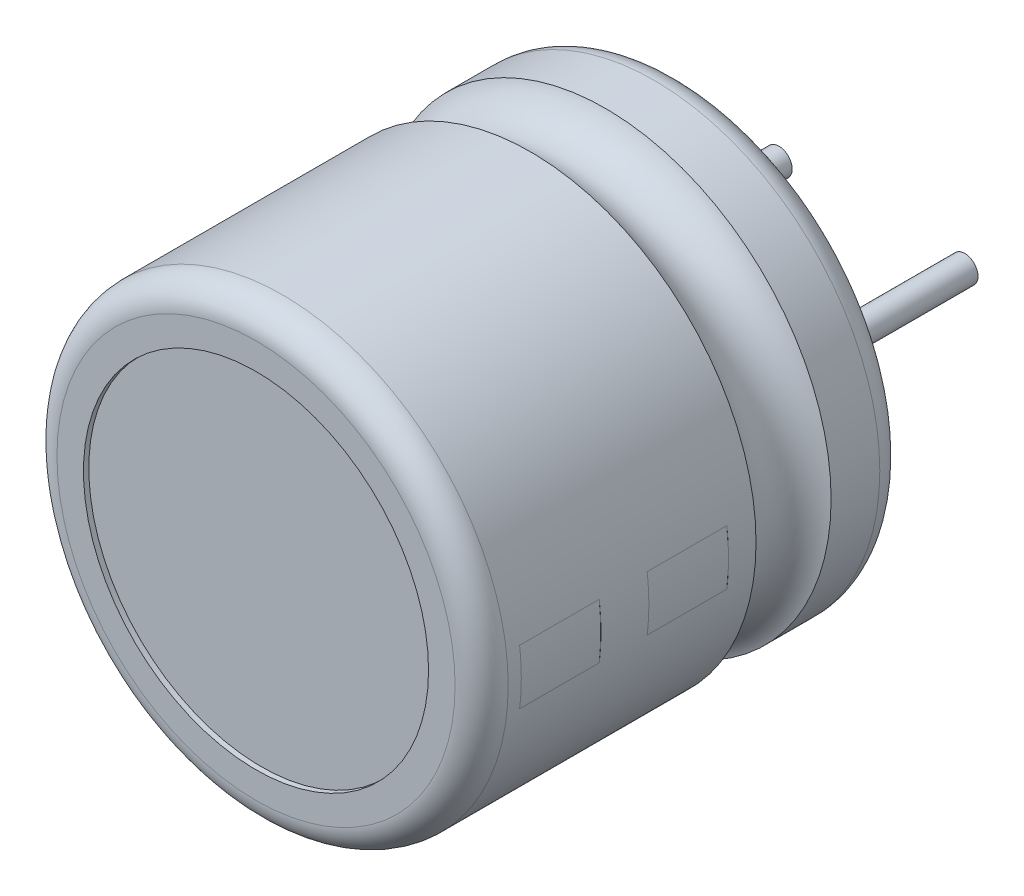
ISO-10303-21;
HEADER;
FILE_DESCRIPTION(('STEP AP214'),'2;1');
FILE_NAME('part.step','',(''),(''),'','','');
FILE_SCHEMA(('AUTOMOTIVE_DESIGN { 1 0 10303 214 1 1 1 1 }'));
ENDSEC;
DATA;
#1=APPLICATION_CONTEXT('core data for automotive mechanical design processes');
#2=APPLICATION_PROTOCOL_DEFINITION('international standard','automotive_design',2000,#1);
#3=PRODUCT_CONTEXT('',#1,'mechanical');
#4=PRODUCT('Part','Part','',(#3));
#5=PRODUCT_RELATED_PRODUCT_CATEGORY('part','',(#4));
#6=PRODUCT_DEFINITION_FORMATION('','',#4);
#7=PRODUCT_DEFINITION_CONTEXT('part definition',#1,'design');
#8=PRODUCT_DEFINITION('design','',#6,#7);
#9=PRODUCT_DEFINITION_SHAPE('','',#8);
#10=(LENGTH_UNIT() NAMED_UNIT(*) SI_UNIT(.MILLI.,.METRE.));
#11=(NAMED_UNIT(*) PLANE_ANGLE_UNIT() SI_UNIT($,.RADIAN.));
#12=(NAMED_UNIT(*) SI_UNIT($,.STERADIAN.) SOLID_ANGLE_UNIT());
#13=UNCERTAINTY_MEASURE_WITH_UNIT(LENGTH_MEASURE(1.E-05),#10,'distance_accuracy_value','');
#14=(GEOMETRIC_REPRESENTATION_CONTEXT(3) GLOBAL_UNCERTAINTY_ASSIGNED_CONTEXT((#13)) GLOBAL_UNIT_ASSIGNED_CONTEXT((#10,
#11,#12)) REPRESENTATION_CONTEXT('',''));
#15=CARTESIAN_POINT('',(0.,0.,0.));
#16=DIRECTION('',(0.,0.,1.));
#17=DIRECTION('',(1.,0.,0.));
#18=AXIS2_PLACEMENT_3D('',#15,#16,#17);
#19=CARTESIAN_POINT('',(4.119066529311,-0.505757775131,4.850664941783));
#20=DIRECTION('',(-0.121869343405041,-0.992546151641335,0.));
#21=DIRECTION('',(0.992546151641335,-0.121869343405041,0.));
#22=AXIS2_PLACEMENT_3D('',#19,#20,#21);
#23=PLANE('',#22);
#24=DIRECTION('',(0.992546151641335,-0.121869343405041,0.));
#25=VECTOR('',#24,1.);
#26=CARTESIAN_POINT('',(4.119066529311,-0.505757775131,4.850664941783));
#27=LINE('',#26,#25);
#28=CARTESIAN_POINT('',(4.21832114447565,-0.517944709471762,4.850664941783));
#29=VERTEX_POINT('',#28);
#30=CARTESIAN_POINT('',(4.11906652931126,-0.505757775131032,4.850664941783));
#31=VERTEX_POINT('',#30);
#32=EDGE_CURVE('P0_E62',#29,#31,#27,.F.);
#33=ORIENTED_EDGE('',*,*,#32,.T.);
#34=DIRECTION('',(0.,0.,1.));
#35=VECTOR('',#34,1.);
#36=CARTESIAN_POINT('',(4.119066529311,-0.505757775131,4.850664941783));
#37=LINE('',#36,#35);
#38=CARTESIAN_POINT('',(4.11906652931126,-0.505757775131032,3.350664941783));
#39=VERTEX_POINT('',#38);
#40=EDGE_CURVE('P0_E65',#31,#39,#37,.F.);
#41=ORIENTED_EDGE('',*,*,#40,.T.);
#42=DIRECTION('',(0.992546151641335,-0.121869343405041,0.));
#43=VECTOR('',#42,1.);
#44=CARTESIAN_POINT('',(4.119066529311,-0.505757775131,3.350664941783));
#45=LINE('',#44,#43);
#46=CARTESIAN_POINT('',(4.21832114447565,-0.517944709471762,3.350664941783));
#47=VERTEX_POINT('',#46);
#48=EDGE_CURVE('P0_E72',#39,#47,#45,.T.);
#49=ORIENTED_EDGE('',*,*,#48,.T.);
#50=DIRECTION('',(0.,0.,-1.));
#51=VECTOR('',#50,1.);
#52=CARTESIAN_POINT('',(4.21832114447562,-0.517944709471953,4.550664941783));
#53=LINE('',#52,#51);
#54=EDGE_CURVE('P0_E64',#29,#47,#53,.T.);
#55=ORIENTED_EDGE('',*,*,#54,.F.);
#56=EDGE_LOOP('',(#33,#41,#49,#55));
#57=FACE_BOUND('',#56,.T.);
#58=ADVANCED_FACE('P0_F17',(#57),#23,.T.);
#59=CARTESIAN_POINT('',(0.,0.,5.150664941783));
#60=DIRECTION('',(0.,0.,-1.));
#61=DIRECTION('',(-1.,0.,0.));
#62=AXIS2_PLACEMENT_3D('',#59,#60,#61);
#63=CYLINDRICAL_SURFACE('',#62,4.15);
#64=CARTESIAN_POINT('',(0.,0.,4.850664941783));
#65=DIRECTION('',(0.,0.,-1.));
#66=DIRECTION('',(-1.,0.,0.));
#67=AXIS2_PLACEMENT_3D('',#64,#65,#66);
#68=CIRCLE('',#67,4.15);
#69=CARTESIAN_POINT('',(4.11906652931123,0.505757775131224,4.850664941783));
#70=VERTEX_POINT('',#69);
#71=EDGE_CURVE('P0_E20',#70,#31,#68,.T.);
#72=ORIENTED_EDGE('',*,*,#71,.F.);
#73=DIRECTION('',(0.,0.,1.));
#74=VECTOR('',#73,1.);
#75=CARTESIAN_POINT('',(4.11906652931095,0.505757775131384,3.850664941783));
#76=LINE('',#75,#74);
#77=CARTESIAN_POINT('',(4.11906652931121,0.505757775131416,3.350664941783));
#78=VERTEX_POINT('',#77);
#79=EDGE_CURVE('P0_E82',#78,#70,#76,.T.);
#80=ORIENTED_EDGE('',*,*,#79,.F.);
#81=CARTESIAN_POINT('',(0.,0.,3.350664941783));
#82=DIRECTION('',(0.,0.,-1.));
#83=DIRECTION('',(-1.,0.,0.));
#84=AXIS2_PLACEMENT_3D('',#81,#82,#83);
#85=CIRCLE('',#84,4.15);
#86=EDGE_CURVE('P0_E55',#78,#39,#85,.T.);
#87=ORIENTED_EDGE('',*,*,#86,.T.);
#88=ORIENTED_EDGE('',*,*,#40,.F.);
#89=EDGE_LOOP('',(#72,#80,#87,#88));
#90=FACE_BOUND('',#89,.T.);
#91=ADVANCED_FACE('P0_F67',(#90),#63,.F.);
#92=CARTESIAN_POINT('',(4.186346410528,0.,3.350664941783));
#93=DIRECTION('',(0.,0.,1.));
#94=DIRECTION('',(1.,0.,0.));
#95=AXIS2_PLACEMENT_3D('',#92,#93,#94);
#96=PLANE('',#95);
#97=ORIENTED_EDGE('',*,*,#48,.F.);
#98=ORIENTED_EDGE('',*,*,#86,.F.);
#99=DIRECTION('',(-0.992546151641335,-0.121869343405041,0.));
#100=VECTOR('',#99,1.);
#101=CARTESIAN_POINT('',(4.218321144476,0.517944709472,3.350664941783));
#102=LINE('',#101,#100);
#103=CARTESIAN_POINT('',(4.21832114447562,0.517944709471954,3.350664941783));
#104=VERTEX_POINT('',#103);
#105=EDGE_CURVE('P0_E80',#104,#78,#102,.T.);
#106=ORIENTED_EDGE('',*,*,#105,.F.);
#107=CARTESIAN_POINT('',(0.,0.,3.350664941783));
#108=DIRECTION('',(0.,0.,-1.));
#109=DIRECTION('',(-1.,0.,0.));
#110=AXIS2_PLACEMENT_3D('',#107,#108,#109);
#111=CIRCLE('',#110,4.25);
#112=EDGE_CURVE('P0_E78',#47,#104,#111,.F.);
#113=ORIENTED_EDGE('',*,*,#112,.F.);
#114=EDGE_LOOP('',(#97,#98,#106,#113));
#115=FACE_BOUND('',#114,.T.);
#116=ADVANCED_FACE('P0_F91',(#115),#96,.F.);
#117=CARTESIAN_POINT('',(4.218321144476,0.517944709472,3.850664941783));
#118=DIRECTION('',(-0.121869343405041,0.992546151641335,0.));
#119=DIRECTION('',(-0.992546151641335,-0.121869343405041,0.));
#120=AXIS2_PLACEMENT_3D('',#117,#118,#119);
#121=PLANE('',#120);
#122=DIRECTION('',(-0.992546151640864,-0.121869343408879,0.));
#123=VECTOR('',#122,1.);
#124=CARTESIAN_POINT('',(4.218321144476,0.517944709472,4.850664941783));
#125=LINE('',#124,#123);
#126=CARTESIAN_POINT('',(4.21832114447562,0.517944709471954,4.850664941783));
#127=VERTEX_POINT('',#126);
#128=EDGE_CURVE('P0_E35',#127,#70,#125,.T.);
#129=ORIENTED_EDGE('',*,*,#128,.F.);
#130=DIRECTION('',(0.,0.,-1.));
#131=VECTOR('',#130,1.);
#132=CARTESIAN_POINT('',(4.21832114447562,0.517944709471954,4.550664941783));
#133=LINE('',#132,#131);
#134=EDGE_CURVE('P0_E26',#104,#127,#133,.F.);
#135=ORIENTED_EDGE('',*,*,#134,.F.);
#136=ORIENTED_EDGE('',*,*,#105,.T.);
#137=ORIENTED_EDGE('',*,*,#79,.T.);
#138=EDGE_LOOP('',(#129,#135,#136,#137));
#139=FACE_BOUND('',#138,.T.);
#140=ADVANCED_FACE('P0_F89',(#139),#121,.T.);
#141=CARTESIAN_POINT('',(4.186346410528,0.,4.850664941783));
#142=DIRECTION('',(0.,0.,1.));
#143=DIRECTION('',(1.,0.,0.));
#144=AXIS2_PLACEMENT_3D('',#141,#142,#143);
#145=PLANE('',#144);
#146=CARTESIAN_POINT('',(0.,0.,4.850664941783));
#147=DIRECTION('',(0.,0.,-1.));
#148=DIRECTION('',(-1.,0.,0.));
#149=AXIS2_PLACEMENT_3D('',#146,#147,#148);
#150=CIRCLE('',#149,4.25);
#151=EDGE_CURVE('P0_E11',#127,#29,#150,.T.);
#152=ORIENTED_EDGE('',*,*,#151,.F.);
#153=ORIENTED_EDGE('',*,*,#128,.T.);
#154=ORIENTED_EDGE('',*,*,#71,.T.);
#155=ORIENTED_EDGE('',*,*,#32,.F.);
#156=EDGE_LOOP('',(#152,#153,#154,#155));
#157=FACE_BOUND('',#156,.T.);
#158=ADVANCED_FACE('P0_F60',(#157),#145,.T.);
#159=CARTESIAN_POINT('',(0.,0.,4.550664941783));
#160=DIRECTION('',(0.,0.,-1.));
#161=DIRECTION('',(-1.,0.,0.));
#162=AXIS2_PLACEMENT_3D('',#159,#160,#161);
#163=CYLINDRICAL_SURFACE('',#162,4.25);
#164=ORIENTED_EDGE('',*,*,#134,.T.);
#165=ORIENTED_EDGE('',*,*,#151,.T.);
#166=ORIENTED_EDGE('',*,*,#54,.T.);
#167=ORIENTED_EDGE('',*,*,#112,.T.);
#168=EDGE_LOOP('',(#164,#165,#166,#167));
#169=FACE_BOUND('',#168,.T.);
#170=ADVANCED_FACE('P0_F86',(#169),#163,.T.);
#171=CLOSED_SHELL('',(#58,#91,#116,#140,#158,#170));
#172=MANIFOLD_SOLID_BREP('P0_B1',#171);
#173=CARTESIAN_POINT('',(4.119066529311,-0.505757775131,7.253360545845));
#174=DIRECTION('',(-0.121869343405041,-0.992546151641335,0.));
#175=DIRECTION('',(0.992546151641335,-0.121869343405041,0.));
#176=AXIS2_PLACEMENT_3D('',#173,#174,#175);
#177=PLANE('',#176);
#178=DIRECTION('',(0.992546151641335,-0.121869343405041,0.));
#179=VECTOR('',#178,1.);
#180=CARTESIAN_POINT('',(4.119066529311,-0.505757775131,7.253360545845));
#181=LINE('',#180,#179);
#182=CARTESIAN_POINT('',(4.21832114447565,-0.517944709471761,7.253360545845));
#183=VERTEX_POINT('',#182);
#184=CARTESIAN_POINT('',(4.11906652931126,-0.505757775131032,7.253360545845));
#185=VERTEX_POINT('',#184);
#186=EDGE_CURVE('P1_E62',#183,#185,#181,.F.);
#187=ORIENTED_EDGE('',*,*,#186,.T.);
#188=DIRECTION('',(0.,0.,1.));
#189=VECTOR('',#188,1.);
#190=CARTESIAN_POINT('',(4.119066529311,-0.505757775131,7.253360545845));
#191=LINE('',#190,#189);
#192=CARTESIAN_POINT('',(4.11906652931126,-0.505757775131032,5.753360545845));
#193=VERTEX_POINT('',#192);
#194=EDGE_CURVE('P1_E65',#185,#193,#191,.F.);
#195=ORIENTED_EDGE('',*,*,#194,.T.);
#196=DIRECTION('',(0.992546151641335,-0.121869343405041,0.));
#197=VECTOR('',#196,1.);
#198=CARTESIAN_POINT('',(4.119066529311,-0.505757775131,5.753360545845));
#199=LINE('',#198,#197);
#200=CARTESIAN_POINT('',(4.21832114447565,-0.517944709471761,5.753360545845));
#201=VERTEX_POINT('',#200);
#202=EDGE_CURVE('P1_E72',#193,#201,#199,.T.);
#203=ORIENTED_EDGE('',*,*,#202,.T.);
#204=DIRECTION('',(0.,0.,-1.));
#205=VECTOR('',#204,1.);
#206=CARTESIAN_POINT('',(4.21832114447562,-0.517944709471953,6.953360545845));
#207=LINE('',#206,#205);
#208=EDGE_CURVE('P1_E64',#183,#201,#207,.T.);
#209=ORIENTED_EDGE('',*,*,#208,.F.);
#210=EDGE_LOOP('',(#187,#195,#203,#209));
#211=FACE_BOUND('',#210,.T.);
#212=ADVANCED_FACE('P1_F17',(#211),#177,.T.);
#213=CARTESIAN_POINT('',(0.,0.,7.553360545845));
#214=DIRECTION('',(0.,0.,-1.));
#215=DIRECTION('',(-1.,0.,0.));
#216=AXIS2_PLACEMENT_3D('',#213,#214,#215);
#217=CYLINDRICAL_SURFACE('',#216,4.15);
#218=CARTESIAN_POINT('',(0.,0.,7.253360545845));
#219=DIRECTION('',(0.,0.,-1.));
#220=DIRECTION('',(-1.,0.,0.));
#221=AXIS2_PLACEMENT_3D('',#218,#219,#220);
#222=CIRCLE('',#221,4.15);
#223=CARTESIAN_POINT('',(4.11906652931123,0.505757775131224,7.253360545845));
#224=VERTEX_POINT('',#223);
#225=EDGE_CURVE('P1_E20',#224,#185,#222,.T.);
#226=ORIENTED_EDGE('',*,*,#225,.F.);
#227=DIRECTION('',(0.,0.,1.));
#228=VECTOR('',#227,1.);
#229=CARTESIAN_POINT('',(4.11906652931095,0.505757775131384,6.253360545845));
#230=LINE('',#229,#228);
#231=CARTESIAN_POINT('',(4.11906652931121,0.505757775131416,5.753360545845));
#232=VERTEX_POINT('',#231);
#233=EDGE_CURVE('P1_E82',#232,#224,#230,.T.);
#234=ORIENTED_EDGE('',*,*,#233,.F.);
#235=CARTESIAN_POINT('',(0.,0.,5.753360545845));
#236=DIRECTION('',(0.,0.,-1.));
#237=DIRECTION('',(-1.,0.,0.));
#238=AXIS2_PLACEMENT_3D('',#235,#236,#237);
#239=CIRCLE('',#238,4.15);
#240=EDGE_CURVE('P1_E55',#232,#193,#239,.T.);
#241=ORIENTED_EDGE('',*,*,#240,.T.);
#242=ORIENTED_EDGE('',*,*,#194,.F.);
#243=EDGE_LOOP('',(#226,#234,#241,#242));
#244=FACE_BOUND('',#243,.T.);
#245=ADVANCED_FACE('P1_F67',(#244),#217,.F.);
#246=CARTESIAN_POINT('',(4.186346410528,0.,5.753360545845));
#247=DIRECTION('',(0.,0.,1.));
#248=DIRECTION('',(1.,0.,0.));
#249=AXIS2_PLACEMENT_3D('',#246,#247,#248);
#250=PLANE('',#249);
#251=ORIENTED_EDGE('',*,*,#202,.F.);
#252=ORIENTED_EDGE('',*,*,#240,.F.);
#253=DIRECTION('',(-0.992546151641335,-0.121869343405041,0.));
#254=VECTOR('',#253,1.);
#255=CARTESIAN_POINT('',(4.218321144476,0.517944709472,5.753360545845));
#256=LINE('',#255,#254);
#257=CARTESIAN_POINT('',(4.21832114447562,0.517944709471954,5.753360545845));
#258=VERTEX_POINT('',#257);
#259=EDGE_CURVE('P1_E80',#258,#232,#256,.T.);
#260=ORIENTED_EDGE('',*,*,#259,.F.);
#261=CARTESIAN_POINT('',(0.,0.,5.753360545845));
#262=DIRECTION('',(0.,0.,-1.));
#263=DIRECTION('',(-1.,0.,0.));
#264=AXIS2_PLACEMENT_3D('',#261,#262,#263);
#265=CIRCLE('',#264,4.25);
#266=EDGE_CURVE('P1_E78',#201,#258,#265,.F.);
#267=ORIENTED_EDGE('',*,*,#266,.F.);
#268=EDGE_LOOP('',(#251,#252,#260,#267));
#269=FACE_BOUND('',#268,.T.);
#270=ADVANCED_FACE('P1_F91',(#269),#250,.F.);
#271=CARTESIAN_POINT('',(4.218321144476,0.517944709472,6.253360545845));
#272=DIRECTION('',(-0.121869343405041,0.992546151641335,0.));
#273=DIRECTION('',(-0.992546151641335,-0.121869343405041,0.));
#274=AXIS2_PLACEMENT_3D('',#271,#272,#273);
#275=PLANE('',#274);
#276=DIRECTION('',(-0.992546151640864,-0.121869343408879,0.));
#277=VECTOR('',#276,1.);
#278=CARTESIAN_POINT('',(4.218321144476,0.517944709472,7.253360545845));
#279=LINE('',#278,#277);
#280=CARTESIAN_POINT('',(4.21832114447562,0.517944709471954,7.253360545845));
#281=VERTEX_POINT('',#280);
#282=EDGE_CURVE('P1_E35',#281,#224,#279,.T.);
#283=ORIENTED_EDGE('',*,*,#282,.F.);
#284=DIRECTION('',(0.,0.,-1.));
#285=VECTOR('',#284,1.);
#286=CARTESIAN_POINT('',(4.21832114447562,0.517944709471954,6.953360545845));
#287=LINE('',#286,#285);
#288=EDGE_CURVE('P1_E26',#258,#281,#287,.F.);
#289=ORIENTED_EDGE('',*,*,#288,.F.);
#290=ORIENTED_EDGE('',*,*,#259,.T.);
#291=ORIENTED_EDGE('',*,*,#233,.T.);
#292=EDGE_LOOP('',(#283,#289,#290,#291));
#293=FACE_BOUND('',#292,.T.);
#294=ADVANCED_FACE('P1_F89',(#293),#275,.T.);
#295=CARTESIAN_POINT('',(4.186346410528,0.,7.253360545845));
#296=DIRECTION('',(0.,0.,1.));
#297=DIRECTION('',(1.,0.,0.));
#298=AXIS2_PLACEMENT_3D('',#295,#296,#297);
#299=PLANE('',#298);
#300=CARTESIAN_POINT('',(0.,0.,7.253360545845));
#301=DIRECTION('',(0.,0.,-1.));
#302=DIRECTION('',(-1.,0.,0.));
#303=AXIS2_PLACEMENT_3D('',#300,#301,#302);
#304=CIRCLE('',#303,4.25);
#305=EDGE_CURVE('P1_E11',#281,#183,#304,.T.);
#306=ORIENTED_EDGE('',*,*,#305,.F.);
#307=ORIENTED_EDGE('',*,*,#282,.T.);
#308=ORIENTED_EDGE('',*,*,#225,.T.);
#309=ORIENTED_EDGE('',*,*,#186,.F.);
#310=EDGE_LOOP('',(#306,#307,#308,#309));
#311=FACE_BOUND('',#310,.T.);
#312=ADVANCED_FACE('P1_F60',(#311),#299,.T.);
#313=CARTESIAN_POINT('',(0.,0.,6.953360545845));
#314=DIRECTION('',(0.,0.,-1.));
#315=DIRECTION('',(-1.,0.,0.));
#316=AXIS2_PLACEMENT_3D('',#313,#314,#315);
#317=CYLINDRICAL_SURFACE('',#316,4.25);
#318=ORIENTED_EDGE('',*,*,#288,.T.);
#319=ORIENTED_EDGE('',*,*,#305,.T.);
#320=ORIENTED_EDGE('',*,*,#208,.T.);
#321=ORIENTED_EDGE('',*,*,#266,.T.);
#322=EDGE_LOOP('',(#318,#319,#320,#321));
#323=FACE_BOUND('',#322,.T.);
#324=ADVANCED_FACE('P1_F86',(#323),#317,.T.);
#325=CLOSED_SHELL('',(#212,#245,#270,#294,#312,#324));
#326=MANIFOLD_SOLID_BREP('P1_B1',#325);
#327=CARTESIAN_POINT('',(0.,0.,0.2));
#328=DIRECTION('',(0.,0.,1.));
#329=DIRECTION('',(1.,0.,0.));
#330=AXIS2_PLACEMENT_3D('',#327,#328,#329);
#331=PLANE('',#330);
#332=CARTESIAN_POINT('',(0.,0.,0.2));
#333=DIRECTION('',(0.,0.,1.));
#334=DIRECTION('',(1.,0.,0.));
#335=AXIS2_PLACEMENT_3D('',#332,#333,#334);
#336=CIRCLE('',#335,3.25);
#337=CARTESIAN_POINT('',(3.25,0.,0.2));
#338=VERTEX_POINT('',#337);
#339=EDGE_CURVE('P2_E195',#338,#338,#336,.F.);
#340=ORIENTED_EDGE('',*,*,#339,.T.);
#341=EDGE_LOOP('',(#340));
#342=FACE_BOUND('',#341,.T.);
#343=ADVANCED_FACE('P2_F25',(#342),#331,.F.);
#344=CARTESIAN_POINT('',(0.,0.,0.));
#345=DIRECTION('',(0.,0.,1.));
#346=DIRECTION('',(1.,0.,0.));
#347=AXIS2_PLACEMENT_3D('',#344,#345,#346);
#348=CYLINDRICAL_SURFACE('',#347,3.25);
#349=ORIENTED_EDGE('',*,*,#339,.F.);
#350=EDGE_LOOP('',(#349));
#351=FACE_BOUND('',#350,.T.);
#352=CARTESIAN_POINT('',(0.,0.,0.));
#353=DIRECTION('',(0.,0.,1.));
#354=DIRECTION('',(1.,0.,0.));
#355=AXIS2_PLACEMENT_3D('',#352,#353,#354);
#356=CIRCLE('',#355,3.25);
#357=CARTESIAN_POINT('',(3.25,0.,0.));
#358=VERTEX_POINT('',#357);
#359=EDGE_CURVE('P2_E191',#358,#358,#356,.F.);
#360=ORIENTED_EDGE('',*,*,#359,.T.);
#361=EDGE_LOOP('',(#360));
#362=FACE_BOUND('',#361,.T.);
#363=ADVANCED_FACE('P2_F445',(#351,#362),#348,.F.);
#364=CARTESIAN_POINT('',(0.,0.,0.));
#365=DIRECTION('',(0.,0.,1.));
#366=DIRECTION('',(1.,0.,0.));
#367=AXIS2_PLACEMENT_3D('',#364,#365,#366);
#368=PLANE('',#367);
#369=ORIENTED_EDGE('',*,*,#359,.F.);
#370=EDGE_LOOP('',(#369));
#371=FACE_BOUND('',#370,.T.);
#372=CARTESIAN_POINT('',(0.,0.,0.));
#373=DIRECTION('',(0.,0.,1.));
#374=DIRECTION('',(-1.,0.,0.));
#375=AXIS2_PLACEMENT_3D('',#372,#373,#374);
#376=CIRCLE('',#375,3.75);
#377=CARTESIAN_POINT('',(-3.75,0.,0.));
#378=VERTEX_POINT('',#377);
#379=CARTESIAN_POINT('',(3.75,0.,0.));
#380=VERTEX_POINT('',#379);
#381=EDGE_CURVE('P2_E194',#378,#380,#376,.T.);
#382=ORIENTED_EDGE('',*,*,#381,.F.);
#383=CARTESIAN_POINT('',(0.,0.,0.));
#384=DIRECTION('',(0.,0.,1.));
#385=DIRECTION('',(1.,0.,0.));
#386=AXIS2_PLACEMENT_3D('',#383,#384,#385);
#387=CIRCLE('',#386,3.75);
#388=EDGE_CURVE('P2_E142',#380,#378,#387,.T.);
#389=ORIENTED_EDGE('',*,*,#388,.F.);
#390=EDGE_LOOP('',(#382,#389));
#391=FACE_BOUND('',#390,.T.);
#392=ADVANCED_FACE('P2_F153',(#371,#391),#368,.F.);
#393=CARTESIAN_POINT('',(0.,0.,0.5));
#394=DIRECTION('',(0.,0.,1.));
#395=DIRECTION('',(1.,0.,0.));
#396=AXIS2_PLACEMENT_3D('',#393,#394,#395);
#397=TOROIDAL_SURFACE('',#396,3.75,0.5);
#398=ORIENTED_EDGE('',*,*,#381,.T.);
#399=ORIENTED_EDGE('',*,*,#388,.T.);
#400=EDGE_LOOP('',(#398,#399));
#401=FACE_BOUND('',#400,.T.);
#402=CARTESIAN_POINT('',(0.,0.,0.5));
#403=DIRECTION('',(0.,0.,1.));
#404=DIRECTION('',(1.,0.,0.));
#405=AXIS2_PLACEMENT_3D('',#402,#403,#404);
#406=CIRCLE('',#405,4.25);
#407=CARTESIAN_POINT('',(4.25,0.,0.5));
#408=VERTEX_POINT('',#407);
#409=EDGE_CURVE('P2_E139',#408,#408,#406,.T.);
#410=ORIENTED_EDGE('',*,*,#409,.F.);
#411=EDGE_LOOP('',(#410));
#412=FACE_BOUND('',#411,.T.);
#413=ADVANCED_FACE('P2_F147',(#401,#412),#397,.T.);
#414=CARTESIAN_POINT('',(0.,0.,7.8));
#415=DIRECTION('',(0.,0.,1.));
#416=DIRECTION('',(1.,0.,0.));
#417=AXIS2_PLACEMENT_3D('',#414,#415,#416);
#418=PLANE('',#417);
#419=CARTESIAN_POINT('',(0.,0.,7.8));
#420=DIRECTION('',(0.,0.,1.));
#421=DIRECTION('',(1.,0.,0.));
#422=AXIS2_PLACEMENT_3D('',#419,#420,#421);
#423=CIRCLE('',#422,3.25);
#424=CARTESIAN_POINT('',(3.25,0.,7.8));
#425=VERTEX_POINT('',#424);
#426=EDGE_CURVE('P2_E138',#425,#425,#423,.T.);
#427=ORIENTED_EDGE('',*,*,#426,.T.);
#428=EDGE_LOOP('',(#427));
#429=FACE_BOUND('',#428,.T.);
#430=ADVANCED_FACE('P2_F152',(#429),#418,.T.);
#431=CARTESIAN_POINT('',(0.,0.,0.));
#432=DIRECTION('',(0.,0.,1.));
#433=DIRECTION('',(1.,0.,0.));
#434=AXIS2_PLACEMENT_3D('',#431,#432,#433);
#435=CYLINDRICAL_SURFACE('',#434,4.25);
#436=ORIENTED_EDGE('',*,*,#409,.T.);
#437=EDGE_LOOP('',(#436));
#438=FACE_BOUND('',#437,.T.);
#439=CARTESIAN_POINT('',(0.,0.,1.41732934011751));
#440=DIRECTION('',(0.,0.,1.));
#441=DIRECTION('',(1.,0.,0.));
#442=AXIS2_PLACEMENT_3D('',#439,#440,#441);
#443=CIRCLE('',#442,4.24999999999983);
#444=CARTESIAN_POINT('',(4.24999999999983,0.,1.41732934011751));
#445=VERTEX_POINT('',#444);
#446=EDGE_CURVE('P2_E135',#445,#445,#443,.F.);
#447=ORIENTED_EDGE('',*,*,#446,.T.);
#448=EDGE_LOOP('',(#447));
#449=FACE_BOUND('',#448,.T.);
#450=ADVANCED_FACE('P2_F417',(#438,#449),#435,.T.);
#451=CARTESIAN_POINT('',(0.,0.,5.8));
#452=DIRECTION('',(0.,0.,1.));
#453=DIRECTION('',(1.,0.,0.));
#454=AXIS2_PLACEMENT_3D('',#451,#452,#453);
#455=CYLINDRICAL_SURFACE('',#454,3.25);
#456=CARTESIAN_POINT('',(0.,0.,8.));
#457=DIRECTION('',(0.,0.,1.));
#458=DIRECTION('',(1.,0.,0.));
#459=AXIS2_PLACEMENT_3D('',#456,#457,#458);
#460=CIRCLE('',#459,3.25);
#461=CARTESIAN_POINT('',(3.25,0.,8.));
#462=VERTEX_POINT('',#461);
#463=EDGE_CURVE('P2_E186',#462,#462,#460,.F.);
#464=ORIENTED_EDGE('',*,*,#463,.F.);
#465=EDGE_LOOP('',(#464));
#466=FACE_BOUND('',#465,.T.);
#467=ORIENTED_EDGE('',*,*,#426,.F.);
#468=EDGE_LOOP('',(#467));
#469=FACE_BOUND('',#468,.T.);
#470=ADVANCED_FACE('P2_F410',(#466,#469),#455,.F.);
#471=CARTESIAN_POINT('',(4.119066529311,-0.505757775131,4.850664941783));
#472=DIRECTION('',(-0.121869343405041,-0.992546151641335,0.));
#473=DIRECTION('',(0.992546151641335,-0.121869343405041,0.));
#474=AXIS2_PLACEMENT_3D('',#471,#472,#473);
#475=PLANE('',#474);
#476=DIRECTION('',(0.,0.,1.));
#477=VECTOR('',#476,1.);
#478=CARTESIAN_POINT('',(4.119066529311,-0.505757775131,4.850664941783));
#479=LINE('',#478,#477);
#480=CARTESIAN_POINT('',(4.11906652931126,-0.505757775131032,4.850664941783));
#481=VERTEX_POINT('',#480);
#482=CARTESIAN_POINT('',(4.11906652931126,-0.505757775131032,3.350664941783));
#483=VERTEX_POINT('',#482);
#484=EDGE_CURVE('P2_E132',#481,#483,#479,.F.);
#485=ORIENTED_EDGE('',*,*,#484,.F.);
#486=DIRECTION('',(0.992546151641335,-0.121869343405041,0.));
#487=VECTOR('',#486,1.);
#488=CARTESIAN_POINT('',(4.119066529311,-0.505757775131,4.850664941783));
#489=LINE('',#488,#487);
#490=CARTESIAN_POINT('',(4.21832114447563,-0.517944709471761,4.850664941783));
#491=VERTEX_POINT('',#490);
#492=EDGE_CURVE('P2_E130',#491,#481,#489,.F.);
#493=ORIENTED_EDGE('',*,*,#492,.F.);
#494=DIRECTION('',(0.,0.,1.));
#495=VECTOR('',#494,1.);
#496=CARTESIAN_POINT('',(4.21832114447561,-0.517944709471954,0.));
#497=LINE('',#496,#495);
#498=CARTESIAN_POINT('',(4.21832114447563,-0.517944709471761,3.350664941783));
#499=VERTEX_POINT('',#498);
#500=EDGE_CURVE('P2_E184',#499,#491,#497,.T.);
#501=ORIENTED_EDGE('',*,*,#500,.F.);
#502=DIRECTION('',(0.992546151641335,-0.121869343405041,0.));
#503=VECTOR('',#502,1.);
#504=CARTESIAN_POINT('',(4.119066529311,-0.505757775131,3.350664941783));
#505=LINE('',#504,#503);
#506=EDGE_CURVE('P2_E121',#483,#499,#505,.T.);
#507=ORIENTED_EDGE('',*,*,#506,.F.);
#508=EDGE_LOOP('',(#485,#493,#501,#507));
#509=FACE_BOUND('',#508,.T.);
#510=ADVANCED_FACE('P2_F287',(#509),#475,.F.);
#511=CARTESIAN_POINT('',(4.119066529311,-0.505757775131,7.253360545845));
#512=DIRECTION('',(-0.121869343405041,-0.992546151641335,0.));
#513=DIRECTION('',(0.992546151641335,-0.121869343405041,0.));
#514=AXIS2_PLACEMENT_3D('',#511,#512,#513);
#515=PLANE('',#514);
#516=DIRECTION('',(0.,0.,1.));
#517=VECTOR('',#516,1.);
#518=CARTESIAN_POINT('',(4.119066529311,-0.505757775131,7.253360545845));
#519=LINE('',#518,#517);
#520=CARTESIAN_POINT('',(4.11906652931126,-0.505757775131032,7.253360545845));
#521=VERTEX_POINT('',#520);
#522=CARTESIAN_POINT('',(4.11906652931126,-0.505757775131032,5.753360545845));
#523=VERTEX_POINT('',#522);
#524=EDGE_CURVE('P2_E105',#521,#523,#519,.F.);
#525=ORIENTED_EDGE('',*,*,#524,.F.);
#526=DIRECTION('',(0.992546151641335,-0.121869343405041,0.));
#527=VECTOR('',#526,1.);
#528=CARTESIAN_POINT('',(4.119066529311,-0.505757775131,7.253360545845));
#529=LINE('',#528,#527);
#530=CARTESIAN_POINT('',(4.21832114447563,-0.517944709471761,7.253360545845));
#531=VERTEX_POINT('',#530);
#532=EDGE_CURVE('P2_E114',#531,#521,#529,.F.);
#533=ORIENTED_EDGE('',*,*,#532,.F.);
#534=DIRECTION('',(0.,0.,1.));
#535=VECTOR('',#534,1.);
#536=CARTESIAN_POINT('',(4.21832114447561,-0.517944709471954,0.));
#537=LINE('',#536,#535);
#538=CARTESIAN_POINT('',(4.21832114447563,-0.517944709471761,5.753360545845));
#539=VERTEX_POINT('',#538);
#540=EDGE_CURVE('P2_E238',#539,#531,#537,.T.);
#541=ORIENTED_EDGE('',*,*,#540,.F.);
#542=DIRECTION('',(0.992546151641335,-0.121869343405041,0.));
#543=VECTOR('',#542,1.);
#544=CARTESIAN_POINT('',(4.119066529311,-0.505757775131,5.753360545845));
#545=LINE('',#544,#543);
#546=EDGE_CURVE('P2_E124',#523,#539,#545,.T.);
#547=ORIENTED_EDGE('',*,*,#546,.F.);
#548=EDGE_LOOP('',(#525,#533,#541,#547));
#549=FACE_BOUND('',#548,.T.);
#550=ADVANCED_FACE('P2_F123',(#549),#515,.F.);
#551=CARTESIAN_POINT('',(0.,0.,8.));
#552=DIRECTION('',(0.,0.,1.));
#553=DIRECTION('',(1.,0.,0.));
#554=AXIS2_PLACEMENT_3D('',#551,#552,#553);
#555=PLANE('',#554);
#556=ORIENTED_EDGE('',*,*,#463,.T.);
#557=EDGE_LOOP('',(#556));
#558=FACE_BOUND('',#557,.T.);
#559=CARTESIAN_POINT('',(0.,0.,8.));
#560=DIRECTION('',(0.,0.,-1.));
#561=DIRECTION('',(1.,0.,0.));
#562=AXIS2_PLACEMENT_3D('',#559,#560,#561);
#563=CIRCLE('',#562,3.75);
#564=CARTESIAN_POINT('',(-3.75,0.,8.));
#565=VERTEX_POINT('',#564);
#566=CARTESIAN_POINT('',(3.75,0.,8.));
#567=VERTEX_POINT('',#566);
#568=EDGE_CURVE('P2_E126',#565,#567,#563,.F.);
#569=ORIENTED_EDGE('',*,*,#568,.T.);
#570=CARTESIAN_POINT('',(0.,0.,8.));
#571=DIRECTION('',(0.,0.,-1.));
#572=DIRECTION('',(-1.,0.,0.));
#573=AXIS2_PLACEMENT_3D('',#570,#571,#572);
#574=CIRCLE('',#573,3.75);
#575=EDGE_CURVE('P2_E111',#565,#567,#574,.T.);
#576=ORIENTED_EDGE('',*,*,#575,.F.);
#577=EDGE_LOOP('',(#569,#576));
#578=FACE_BOUND('',#577,.T.);
#579=ADVANCED_FACE('P2_F248',(#558,#578),#555,.T.);
#580=CARTESIAN_POINT('',(0.,0.,7.553360545845));
#581=DIRECTION('',(0.,0.,-1.));
#582=DIRECTION('',(-1.,0.,0.));
#583=AXIS2_PLACEMENT_3D('',#580,#581,#582);
#584=CYLINDRICAL_SURFACE('',#583,4.15);
#585=DIRECTION('',(0.,0.,1.));
#586=VECTOR('',#585,1.);
#587=CARTESIAN_POINT('',(4.11906652931095,0.505757775131384,6.253360545845));
#588=LINE('',#587,#586);
#589=CARTESIAN_POINT('',(4.11906652931123,0.505757775131224,5.753360545845));
#590=VERTEX_POINT('',#589);
#591=CARTESIAN_POINT('',(4.11906652931121,0.505757775131416,7.253360545845));
#592=VERTEX_POINT('',#591);
#593=EDGE_CURVE('P2_E108',#590,#592,#588,.T.);
#594=ORIENTED_EDGE('',*,*,#593,.T.);
#595=CARTESIAN_POINT('',(0.,0.,7.253360545845));
#596=DIRECTION('',(0.,0.,-1.));
#597=DIRECTION('',(-1.,0.,0.));
#598=AXIS2_PLACEMENT_3D('',#595,#596,#597);
#599=CIRCLE('',#598,4.15);
#600=EDGE_CURVE('P2_E101',#592,#521,#599,.T.);
#601=ORIENTED_EDGE('',*,*,#600,.T.);
#602=ORIENTED_EDGE('',*,*,#524,.T.);
#603=CARTESIAN_POINT('',(0.,0.,5.753360545845));
#604=DIRECTION('',(0.,0.,-1.));
#605=DIRECTION('',(-1.,0.,0.));
#606=AXIS2_PLACEMENT_3D('',#603,#604,#605);
#607=CIRCLE('',#606,4.15);
#608=EDGE_CURVE('P2_E94',#523,#590,#607,.F.);
#609=ORIENTED_EDGE('',*,*,#608,.T.);
#610=EDGE_LOOP('',(#594,#601,#602,#609));
#611=FACE_BOUND('',#610,.T.);
#612=ADVANCED_FACE('P2_F103',(#611),#584,.T.);
#613=CARTESIAN_POINT('',(0.,0.,5.150664941783));
#614=DIRECTION('',(0.,0.,-1.));
#615=DIRECTION('',(-1.,0.,0.));
#616=AXIS2_PLACEMENT_3D('',#613,#614,#615);
#617=CYLINDRICAL_SURFACE('',#616,4.15);
#618=DIRECTION('',(0.,0.,1.));
#619=VECTOR('',#618,1.);
#620=CARTESIAN_POINT('',(4.11906652931095,0.505757775131384,3.850664941783));
#621=LINE('',#620,#619);
#622=CARTESIAN_POINT('',(4.11906652931123,0.505757775131224,3.350664941783));
#623=VERTEX_POINT('',#622);
#624=CARTESIAN_POINT('',(4.11906652931121,0.505757775131416,4.850664941783));
#625=VERTEX_POINT('',#624);
#626=EDGE_CURVE('P2_E179',#623,#625,#621,.T.);
#627=ORIENTED_EDGE('',*,*,#626,.T.);
#628=CARTESIAN_POINT('',(0.,0.,4.850664941783));
#629=DIRECTION('',(0.,0.,-1.));
#630=DIRECTION('',(-1.,0.,0.));
#631=AXIS2_PLACEMENT_3D('',#628,#629,#630);
#632=CIRCLE('',#631,4.15);
#633=EDGE_CURVE('P2_E178',#625,#481,#632,.T.);
#634=ORIENTED_EDGE('',*,*,#633,.T.);
#635=ORIENTED_EDGE('',*,*,#484,.T.);
#636=CARTESIAN_POINT('',(0.,0.,3.350664941783));
#637=DIRECTION('',(0.,0.,-1.));
#638=DIRECTION('',(-1.,0.,0.));
#639=AXIS2_PLACEMENT_3D('',#636,#637,#638);
#640=CIRCLE('',#639,4.15);
#641=EDGE_CURVE('P2_E182',#483,#623,#640,.F.);
#642=ORIENTED_EDGE('',*,*,#641,.T.);
#643=EDGE_LOOP('',(#627,#634,#635,#642));
#644=FACE_BOUND('',#643,.T.);
#645=ADVANCED_FACE('P2_F378',(#644),#617,.T.);
#646=CARTESIAN_POINT('',(0.,0.,2.124436121304));
#647=DIRECTION('',(0.,0.,1.));
#648=DIRECTION('',(1.,0.,0.));
#649=AXIS2_PLACEMENT_3D('',#646,#647,#648);
#650=TOROIDAL_SURFACE('',#649,4.5,0.75);
#651=ORIENTED_EDGE('',*,*,#446,.F.);
#652=EDGE_LOOP('',(#651));
#653=FACE_BOUND('',#652,.T.);
#654=CARTESIAN_POINT('',(0.,0.,2.831542902491));
#655=DIRECTION('',(0.,0.,1.));
#656=DIRECTION('',(1.,0.,0.));
#657=AXIS2_PLACEMENT_3D('',#654,#655,#656);
#658=CIRCLE('',#657,4.25);
#659=CARTESIAN_POINT('',(4.25,0.,2.831542902491));
#660=VERTEX_POINT('',#659);
#661=EDGE_CURVE('P2_E231',#660,#660,#658,.T.);
#662=ORIENTED_EDGE('',*,*,#661,.F.);
#663=EDGE_LOOP('',(#662));
#664=FACE_BOUND('',#663,.T.);
#665=ADVANCED_FACE('P2_F218',(#653,#664),#650,.F.);
#666=CARTESIAN_POINT('',(0.,0.,7.5));
#667=DIRECTION('',(0.,0.,-1.));
#668=DIRECTION('',(-1.,0.,0.));
#669=AXIS2_PLACEMENT_3D('',#666,#667,#668);
#670=TOROIDAL_SURFACE('',#669,3.75,0.5);
#671=CARTESIAN_POINT('',(0.,0.,7.5));
#672=DIRECTION('',(0.,0.,1.));
#673=DIRECTION('',(1.,0.,0.));
#674=AXIS2_PLACEMENT_3D('',#671,#672,#673);
#675=CIRCLE('',#674,4.25);
#676=CARTESIAN_POINT('',(4.25,0.,7.5));
#677=VERTEX_POINT('',#676);
#678=EDGE_CURVE('P2_E177',#677,#677,#675,.F.);
#679=ORIENTED_EDGE('',*,*,#678,.F.);
#680=EDGE_LOOP('',(#679));
#681=FACE_BOUND('',#680,.T.);
#682=ORIENTED_EDGE('',*,*,#575,.T.);
#683=ORIENTED_EDGE('',*,*,#568,.F.);
#684=EDGE_LOOP('',(#682,#683));
#685=FACE_BOUND('',#684,.T.);
#686=ADVANCED_FACE('P2_F207',(#681,#685),#670,.T.);
#687=CARTESIAN_POINT('',(4.186346410528,0.,7.253360545845));
#688=DIRECTION('',(0.,0.,1.));
#689=DIRECTION('',(1.,0.,0.));
#690=AXIS2_PLACEMENT_3D('',#687,#688,#689);
#691=PLANE('',#690);
#692=DIRECTION('',(-0.992546151641335,-0.121869343405041,0.));
#693=VECTOR('',#692,1.);
#694=CARTESIAN_POINT('',(4.218321144476,0.517944709472,7.253360545845));
#695=LINE('',#694,#693);
#696=CARTESIAN_POINT('',(4.21832114447561,0.517944709471952,7.253360545845));
#697=VERTEX_POINT('',#696);
#698=EDGE_CURVE('P2_E227',#592,#697,#695,.F.);
#699=ORIENTED_EDGE('',*,*,#698,.T.);
#700=CARTESIAN_POINT('',(0.,0.,7.253360545845));
#701=DIRECTION('',(0.,0.,1.));
#702=DIRECTION('',(1.,0.,0.));
#703=AXIS2_PLACEMENT_3D('',#700,#701,#702);
#704=CIRCLE('',#703,4.25);
#705=EDGE_CURVE('P2_E117',#531,#697,#704,.T.);
#706=ORIENTED_EDGE('',*,*,#705,.F.);
#707=ORIENTED_EDGE('',*,*,#532,.T.);
#708=ORIENTED_EDGE('',*,*,#600,.F.);
#709=EDGE_LOOP('',(#699,#706,#707,#708));
#710=FACE_BOUND('',#709,.T.);
#711=ADVANCED_FACE('P2_F115',(#710),#691,.F.);
#712=CARTESIAN_POINT('',(4.218321144476,0.517944709472,6.253360545845));
#713=DIRECTION('',(-0.121869343405041,0.992546151641335,0.));
#714=DIRECTION('',(-0.992546151641335,-0.121869343405041,0.));
#715=AXIS2_PLACEMENT_3D('',#712,#713,#714);
#716=PLANE('',#715);
#717=DIRECTION('',(0.,0.,1.));
#718=VECTOR('',#717,1.);
#719=CARTESIAN_POINT('',(4.21832114447561,0.517944709471952,0.));
#720=LINE('',#719,#718);
#721=CARTESIAN_POINT('',(4.21832114447561,0.517944709471952,5.753360545845));
#722=VERTEX_POINT('',#721);
#723=EDGE_CURVE('P2_E175',#697,#722,#720,.F.);
#724=ORIENTED_EDGE('',*,*,#723,.F.);
#725=ORIENTED_EDGE('',*,*,#698,.F.);
#726=ORIENTED_EDGE('',*,*,#593,.F.);
#727=DIRECTION('',(-0.992546151640864,-0.121869343408879,0.));
#728=VECTOR('',#727,1.);
#729=CARTESIAN_POINT('',(4.218321144476,0.517944709472,5.753360545845));
#730=LINE('',#729,#728);
#731=EDGE_CURVE('P2_E180',#722,#590,#730,.T.);
#732=ORIENTED_EDGE('',*,*,#731,.F.);
#733=EDGE_LOOP('',(#724,#725,#726,#732));
#734=FACE_BOUND('',#733,.T.);
#735=ADVANCED_FACE('P2_F302',(#734),#716,.F.);
#736=CARTESIAN_POINT('',(4.186346410528,0.,5.753360545845));
#737=DIRECTION('',(0.,0.,1.));
#738=DIRECTION('',(1.,0.,0.));
#739=AXIS2_PLACEMENT_3D('',#736,#737,#738);
#740=PLANE('',#739);
#741=ORIENTED_EDGE('',*,*,#608,.F.);
#742=ORIENTED_EDGE('',*,*,#546,.T.);
#743=CARTESIAN_POINT('',(0.,0.,5.753360545845));
#744=DIRECTION('',(0.,0.,1.));
#745=DIRECTION('',(1.,0.,0.));
#746=AXIS2_PLACEMENT_3D('',#743,#744,#745);
#747=CIRCLE('',#746,4.25);
#748=EDGE_CURVE('P2_E173',#722,#539,#747,.F.);
#749=ORIENTED_EDGE('',*,*,#748,.F.);
#750=ORIENTED_EDGE('',*,*,#731,.T.);
#751=EDGE_LOOP('',(#741,#742,#749,#750));
#752=FACE_BOUND('',#751,.T.);
#753=ADVANCED_FACE('P2_F303',(#752),#740,.T.);
#754=CARTESIAN_POINT('',(4.186346410528,0.,4.850664941783));
#755=DIRECTION('',(0.,0.,1.));
#756=DIRECTION('',(1.,0.,0.));
#757=AXIS2_PLACEMENT_3D('',#754,#755,#756);
#758=PLANE('',#757);
#759=DIRECTION('',(-0.992546151641335,-0.121869343405041,0.));
#760=VECTOR('',#759,1.);
#761=CARTESIAN_POINT('',(4.218321144476,0.517944709472,4.850664941783));
#762=LINE('',#761,#760);
#763=CARTESIAN_POINT('',(4.21832114447561,0.517944709471952,4.850664941783));
#764=VERTEX_POINT('',#763);
#765=EDGE_CURVE('P2_E235',#625,#764,#762,.F.);
#766=ORIENTED_EDGE('',*,*,#765,.T.);
#767=CARTESIAN_POINT('',(0.,0.,4.850664941783));
#768=DIRECTION('',(0.,0.,1.));
#769=DIRECTION('',(1.,0.,0.));
#770=AXIS2_PLACEMENT_3D('',#767,#768,#769);
#771=CIRCLE('',#770,4.25);
#772=EDGE_CURVE('P2_E170',#491,#764,#771,.T.);
#773=ORIENTED_EDGE('',*,*,#772,.F.);
#774=ORIENTED_EDGE('',*,*,#492,.T.);
#775=ORIENTED_EDGE('',*,*,#633,.F.);
#776=EDGE_LOOP('',(#766,#773,#774,#775));
#777=FACE_BOUND('',#776,.T.);
#778=ADVANCED_FACE('P2_F305',(#777),#758,.F.);
#779=CARTESIAN_POINT('',(4.218321144476,0.517944709472,3.850664941783));
#780=DIRECTION('',(-0.121869343405041,0.992546151641335,0.));
#781=DIRECTION('',(-0.992546151641335,-0.121869343405041,0.));
#782=AXIS2_PLACEMENT_3D('',#779,#780,#781);
#783=PLANE('',#782);
#784=DIRECTION('',(0.,0.,1.));
#785=VECTOR('',#784,1.);
#786=CARTESIAN_POINT('',(4.21832114447561,0.517944709471952,0.));
#787=LINE('',#786,#785);
#788=CARTESIAN_POINT('',(4.21832114447561,0.517944709471952,3.350664941783));
#789=VERTEX_POINT('',#788);
#790=EDGE_CURVE('P2_E36',#764,#789,#787,.F.);
#791=ORIENTED_EDGE('',*,*,#790,.F.);
#792=ORIENTED_EDGE('',*,*,#765,.F.);
#793=ORIENTED_EDGE('',*,*,#626,.F.);
#794=DIRECTION('',(-0.992546151640864,-0.121869343408879,0.));
#795=VECTOR('',#794,1.);
#796=CARTESIAN_POINT('',(4.218321144476,0.517944709472,3.350664941783));
#797=LINE('',#796,#795);
#798=EDGE_CURVE('P2_E45',#789,#623,#797,.T.);
#799=ORIENTED_EDGE('',*,*,#798,.F.);
#800=EDGE_LOOP('',(#791,#792,#793,#799));
#801=FACE_BOUND('',#800,.T.);
#802=ADVANCED_FACE('P2_F312',(#801),#783,.F.);
#803=CARTESIAN_POINT('',(4.186346410528,0.,3.350664941783));
#804=DIRECTION('',(0.,0.,1.));
#805=DIRECTION('',(1.,0.,0.));
#806=AXIS2_PLACEMENT_3D('',#803,#804,#805);
#807=PLANE('',#806);
#808=ORIENTED_EDGE('',*,*,#641,.F.);
#809=ORIENTED_EDGE('',*,*,#506,.T.);
#810=CARTESIAN_POINT('',(0.,0.,3.350664941783));
#811=DIRECTION('',(0.,0.,1.));
#812=DIRECTION('',(1.,0.,0.));
#813=AXIS2_PLACEMENT_3D('',#810,#811,#812);
#814=CIRCLE('',#813,4.25);
#815=EDGE_CURVE('P2_E13',#789,#499,#814,.F.);
#816=ORIENTED_EDGE('',*,*,#815,.F.);
#817=ORIENTED_EDGE('',*,*,#798,.T.);
#818=EDGE_LOOP('',(#808,#809,#816,#817));
#819=FACE_BOUND('',#818,.T.);
#820=ADVANCED_FACE('P2_F282',(#819),#807,.T.);
#821=CARTESIAN_POINT('',(0.,0.,0.));
#822=DIRECTION('',(0.,0.,1.));
#823=DIRECTION('',(1.,0.,0.));
#824=AXIS2_PLACEMENT_3D('',#821,#822,#823);
#825=CYLINDRICAL_SURFACE('',#824,4.25);
#826=ORIENTED_EDGE('',*,*,#748,.T.);
#827=ORIENTED_EDGE('',*,*,#540,.T.);
#828=ORIENTED_EDGE('',*,*,#705,.T.);
#829=ORIENTED_EDGE('',*,*,#723,.T.);
#830=EDGE_LOOP('',(#826,#827,#828,#829));
#831=FACE_BOUND('',#830,.T.);
#832=ORIENTED_EDGE('',*,*,#678,.T.);
#833=EDGE_LOOP('',(#832));
#834=FACE_BOUND('',#833,.T.);
#835=ORIENTED_EDGE('',*,*,#661,.T.);
#836=EDGE_LOOP('',(#835));
#837=FACE_BOUND('',#836,.T.);
#838=ORIENTED_EDGE('',*,*,#790,.T.);
#839=ORIENTED_EDGE('',*,*,#815,.T.);
#840=ORIENTED_EDGE('',*,*,#500,.T.);
#841=ORIENTED_EDGE('',*,*,#772,.T.);
#842=EDGE_LOOP('',(#838,#839,#840,#841));
#843=FACE_BOUND('',#842,.T.);
#844=ADVANCED_FACE('P2_F290',(#831,#834,#837,#843),#825,.T.);
#845=CLOSED_SHELL('',(#343,#363,#392,#413,#430,#450,#470,#510,#550,#579,#612,#645,#665,#686,
#711,#735,#753,#778,#802,#820,#844));
#846=MANIFOLD_SOLID_BREP('P2_B1',#845);
#847=CARTESIAN_POINT('',(0.,0.,7.8));
#848=DIRECTION('',(0.,0.,1.));
#849=DIRECTION('',(1.,0.,0.));
#850=AXIS2_PLACEMENT_3D('',#847,#848,#849);
#851=PLANE('',#850);
#852=CARTESIAN_POINT('',(0.,0.,7.8));
#853=DIRECTION('',(0.,0.,1.));
#854=DIRECTION('',(1.,0.,0.));
#855=AXIS2_PLACEMENT_3D('',#852,#853,#854);
#856=CIRCLE('',#855,3.25);
#857=CARTESIAN_POINT('',(3.25,0.,7.8));
#858=VERTEX_POINT('',#857);
#859=EDGE_CURVE('P3_E18',#858,#858,#856,.T.);
#860=ORIENTED_EDGE('',*,*,#859,.F.);
#861=EDGE_LOOP('',(#860));
#862=FACE_BOUND('',#861,.T.);
#863=ADVANCED_FACE('P3_F15',(#862),#851,.F.);
#864=CARTESIAN_POINT('',(0.,0.,7.8));
#865=DIRECTION('',(0.,0.,1.));
#866=DIRECTION('',(1.,0.,0.));
#867=AXIS2_PLACEMENT_3D('',#864,#865,#866);
#868=CYLINDRICAL_SURFACE('',#867,3.25);
#869=ORIENTED_EDGE('',*,*,#859,.T.);
#870=EDGE_LOOP('',(#869));
#871=FACE_BOUND('',#870,.T.);
#872=CARTESIAN_POINT('',(0.,0.,7.9));
#873=DIRECTION('',(0.,0.,1.));
#874=DIRECTION('',(1.,0.,0.));
#875=AXIS2_PLACEMENT_3D('',#872,#873,#874);
#876=CIRCLE('',#875,3.25);
#877=CARTESIAN_POINT('',(3.25,0.,7.9));
#878=VERTEX_POINT('',#877);
#879=EDGE_CURVE('P3_E10',#878,#878,#876,.T.);
#880=ORIENTED_EDGE('',*,*,#879,.F.);
#881=EDGE_LOOP('',(#880));
#882=FACE_BOUND('',#881,.T.);
#883=ADVANCED_FACE('P3_F27',(#871,#882),#868,.T.);
#884=CARTESIAN_POINT('',(0.,0.,7.9));
#885=DIRECTION('',(0.,0.,1.));
#886=DIRECTION('',(1.,0.,0.));
#887=AXIS2_PLACEMENT_3D('',#884,#885,#886);
#888=PLANE('',#887);
#889=ORIENTED_EDGE('',*,*,#879,.T.);
#890=EDGE_LOOP('',(#889));
#891=FACE_BOUND('',#890,.T.);
#892=ADVANCED_FACE('P3_F35',(#891),#888,.T.);
#893=CLOSED_SHELL('',(#863,#883,#892));
#894=MANIFOLD_SOLID_BREP('P3_B1',#893);
#895=CARTESIAN_POINT('',(0.,0.,0.2));
#896=DIRECTION('',(0.,0.,1.));
#897=DIRECTION('',(1.,0.,0.));
#898=AXIS2_PLACEMENT_3D('',#895,#896,#897);
#899=PLANE('',#898);
#900=CARTESIAN_POINT('',(0.,0.,0.2));
#901=DIRECTION('',(0.,0.,-1.));
#902=DIRECTION('',(-1.,0.,0.));
#903=AXIS2_PLACEMENT_3D('',#900,#901,#902);
#904=CIRCLE('',#903,3.25);
#905=CARTESIAN_POINT('',(-3.25,0.,0.2));
#906=VERTEX_POINT('',#905);
#907=EDGE_CURVE('P4_E18',#906,#906,#904,.T.);
#908=ORIENTED_EDGE('',*,*,#907,.F.);
#909=EDGE_LOOP('',(#908));
#910=FACE_BOUND('',#909,.T.);
#911=ADVANCED_FACE('P4_F15',(#910),#899,.T.);
#912=CARTESIAN_POINT('',(0.,0.,0.2));
#913=DIRECTION('',(0.,0.,-1.));
#914=DIRECTION('',(-1.,0.,0.));
#915=AXIS2_PLACEMENT_3D('',#912,#913,#914);
#916=CYLINDRICAL_SURFACE('',#915,3.25);
#917=CARTESIAN_POINT('',(0.,0.,0.1));
#918=DIRECTION('',(0.,0.,-1.));
#919=DIRECTION('',(-1.,0.,0.));
#920=AXIS2_PLACEMENT_3D('',#917,#918,#919);
#921=CIRCLE('',#920,3.25);
#922=CARTESIAN_POINT('',(-3.25,0.,0.1));
#923=VERTEX_POINT('',#922);
#924=EDGE_CURVE('P4_E10',#923,#923,#921,.F.);
#925=ORIENTED_EDGE('',*,*,#924,.T.);
#926=EDGE_LOOP('',(#925));
#927=FACE_BOUND('',#926,.T.);
#928=ORIENTED_EDGE('',*,*,#907,.T.);
#929=EDGE_LOOP('',(#928));
#930=FACE_BOUND('',#929,.T.);
#931=ADVANCED_FACE('P4_F27',(#927,#930),#916,.T.);
#932=CARTESIAN_POINT('',(0.,0.,0.1));
#933=DIRECTION('',(0.,0.,1.));
#934=DIRECTION('',(1.,0.,0.));
#935=AXIS2_PLACEMENT_3D('',#932,#933,#934);
#936=PLANE('',#935);
#937=ORIENTED_EDGE('',*,*,#924,.F.);
#938=EDGE_LOOP('',(#937));
#939=FACE_BOUND('',#938,.T.);
#940=ADVANCED_FACE('P4_F34',(#939),#936,.F.);
#941=CLOSED_SHELL('',(#911,#931,#940));
#942=MANIFOLD_SOLID_BREP('P4_B1',#941);
#943=CARTESIAN_POINT('',(1.75,0.,0.));
#944=DIRECTION('',(0.,0.,1.));
#945=DIRECTION('',(1.,0.,0.));
#946=AXIS2_PLACEMENT_3D('',#943,#944,#945);
#947=PLANE('',#946);
#948=CARTESIAN_POINT('',(1.75,0.,0.));
#949=DIRECTION('',(0.,0.,-1.));
#950=DIRECTION('',(-1.,0.,0.));
#951=AXIS2_PLACEMENT_3D('',#948,#949,#950);
#952=CIRCLE('',#951,0.25);
#953=CARTESIAN_POINT('',(1.5,0.,0.));
#954=VERTEX_POINT('',#953);
#955=EDGE_CURVE('P5_E26',#954,#954,#952,.T.);
#956=ORIENTED_EDGE('',*,*,#955,.F.);
#957=EDGE_LOOP('',(#956));
#958=FACE_BOUND('',#957,.T.);
#959=ADVANCED_FACE('P5_F23',(#958),#947,.T.);
#960=CARTESIAN_POINT('',(1.75,0.,-3.6));
#961=DIRECTION('',(0.,0.,1.));
#962=DIRECTION('',(1.,0.,0.));
#963=AXIS2_PLACEMENT_3D('',#960,#961,#962);
#964=PLANE('',#963);
#965=CARTESIAN_POINT('',(1.75,0.,-3.6));
#966=DIRECTION('',(0.,0.,-1.));
#967=DIRECTION('',(-1.,0.,0.));
#968=AXIS2_PLACEMENT_3D('',#965,#966,#967);
#969=CIRCLE('',#968,0.25);
#970=CARTESIAN_POINT('',(1.5,0.,-3.6));
#971=VERTEX_POINT('',#970);
#972=EDGE_CURVE('P5_E12',#971,#971,#969,.F.);
#973=ORIENTED_EDGE('',*,*,#972,.F.);
#974=EDGE_LOOP('',(#973));
#975=FACE_BOUND('',#974,.T.);
#976=ADVANCED_FACE('P5_F38',(#975),#964,.F.);
#977=CARTESIAN_POINT('',(1.75,0.,0.));
#978=DIRECTION('',(0.,0.,-1.));
#979=DIRECTION('',(-1.,0.,0.));
#980=AXIS2_PLACEMENT_3D('',#977,#978,#979);
#981=CYLINDRICAL_SURFACE('',#980,0.25);
#982=ORIENTED_EDGE('',*,*,#955,.T.);
#983=EDGE_LOOP('',(#982));
#984=FACE_BOUND('',#983,.T.);
#985=ORIENTED_EDGE('',*,*,#972,.T.);
#986=EDGE_LOOP('',(#985));
#987=FACE_BOUND('',#986,.T.);
#988=ADVANCED_FACE('P5_F35',(#984,#987),#981,.T.);
#989=CLOSED_SHELL('',(#959,#976,#988));
#990=MANIFOLD_SOLID_BREP('P5_B1',#989);
#991=CARTESIAN_POINT('',(-1.75,0.,0.));
#992=DIRECTION('',(0.,0.,1.));
#993=DIRECTION('',(1.,0.,0.));
#994=AXIS2_PLACEMENT_3D('',#991,#992,#993);
#995=PLANE('',#994);
#996=CARTESIAN_POINT('',(-1.75,0.,0.));
#997=DIRECTION('',(0.,0.,-1.));
#998=DIRECTION('',(-1.,0.,0.));
#999=AXIS2_PLACEMENT_3D('',#996,#997,#998);
#1000=CIRCLE('',#999,0.25);
#1001=CARTESIAN_POINT('',(-2.,0.,0.));
#1002=VERTEX_POINT('',#1001);
#1003=EDGE_CURVE('P6_E26',#1002,#1002,#1000,.T.);
#1004=ORIENTED_EDGE('',*,*,#1003,.F.);
#1005=EDGE_LOOP('',(#1004));
#1006=FACE_BOUND('',#1005,.T.);
#1007=ADVANCED_FACE('P6_F23',(#1006),#995,.T.);
#1008=CARTESIAN_POINT('',(-1.75,0.,-3.6));
#1009=DIRECTION('',(0.,0.,1.));
#1010=DIRECTION('',(1.,0.,0.));
#1011=AXIS2_PLACEMENT_3D('',#1008,#1009,#1010);
#1012=PLANE('',#1011);
#1013=CARTESIAN_POINT('',(-1.75,0.,-3.6));
#1014=DIRECTION('',(0.,0.,-1.));
#1015=DIRECTION('',(-1.,0.,0.));
#1016=AXIS2_PLACEMENT_3D('',#1013,#1014,#1015);
#1017=CIRCLE('',#1016,0.25);
#1018=CARTESIAN_POINT('',(-2.,0.,-3.6));
#1019=VERTEX_POINT('',#1018);
#1020=EDGE_CURVE('P6_E12',#1019,#1019,#1017,.F.);
#1021=ORIENTED_EDGE('',*,*,#1020,.F.);
#1022=EDGE_LOOP('',(#1021));
#1023=FACE_BOUND('',#1022,.T.);
#1024=ADVANCED_FACE('P6_F38',(#1023),#1012,.F.);
#1025=CARTESIAN_POINT('',(-1.75,0.,0.));
#1026=DIRECTION('',(0.,0.,-1.));
#1027=DIRECTION('',(-1.,0.,0.));
#1028=AXIS2_PLACEMENT_3D('',#1025,#1026,#1027);
#1029=CYLINDRICAL_SURFACE('',#1028,0.25);
#1030=ORIENTED_EDGE('',*,*,#1003,.T.);
#1031=EDGE_LOOP('',(#1030));
#1032=FACE_BOUND('',#1031,.T.);
#1033=ORIENTED_EDGE('',*,*,#1020,.T.);
#1034=EDGE_LOOP('',(#1033));
#1035=FACE_BOUND('',#1034,.T.);
#1036=ADVANCED_FACE('P6_F35',(#1032,#1035),#1029,.T.);
#1037=CLOSED_SHELL('',(#1007,#1024,#1036));
#1038=MANIFOLD_SOLID_BREP('P6_B1',#1037);
#1039=ADVANCED_BREP_SHAPE_REPRESENTATION('',(#18,#172,#326,#846,#894,#942,#990,#1038),#14);
#1040=SHAPE_DEFINITION_REPRESENTATION(#9,#1039);
ENDSEC;
END-ISO-10303-21;
